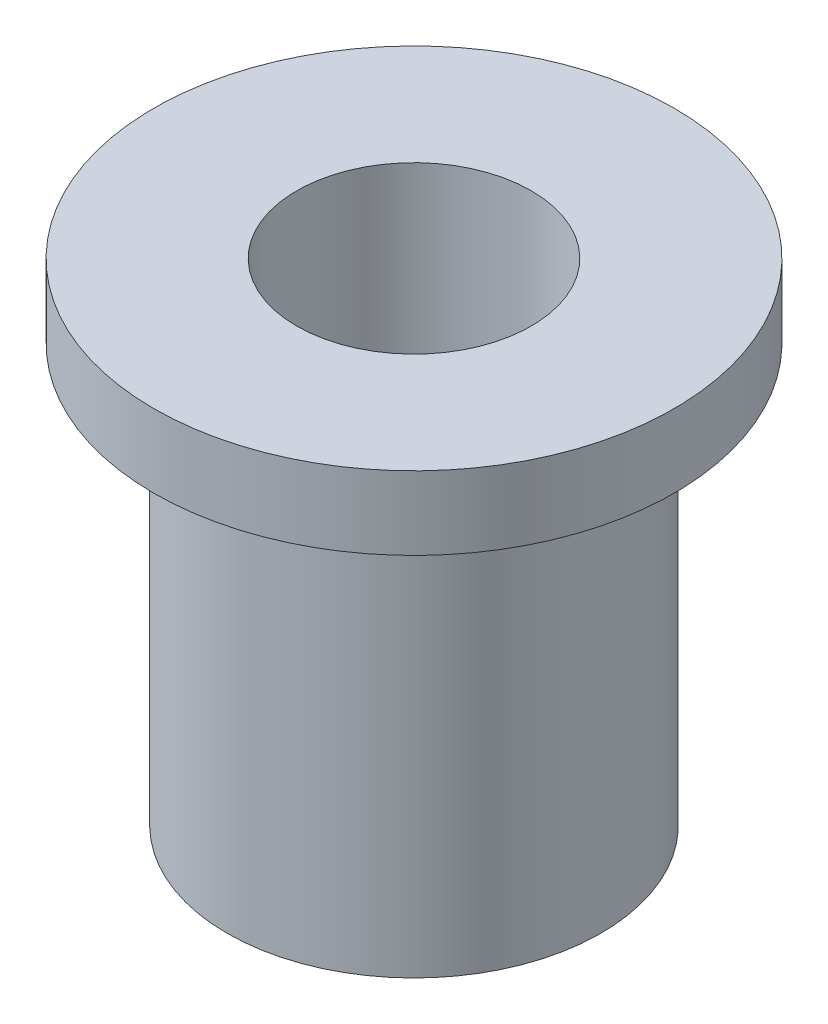
ISO-10303-21;
HEADER;
FILE_DESCRIPTION(('STEP AP214'),'2;1');
FILE_NAME('part.step','',(''),(''),'','','');
FILE_SCHEMA(('AUTOMOTIVE_DESIGN { 1 0 10303 214 1 1 1 1 }'));
ENDSEC;
DATA;
#1=APPLICATION_CONTEXT('core data for automotive mechanical design processes');
#2=APPLICATION_PROTOCOL_DEFINITION('international standard','automotive_design',2000,#1);
#3=PRODUCT_CONTEXT('',#1,'mechanical');
#4=PRODUCT('Part','Part','',(#3));
#5=PRODUCT_RELATED_PRODUCT_CATEGORY('part','',(#4));
#6=PRODUCT_DEFINITION_FORMATION('','',#4);
#7=PRODUCT_DEFINITION_CONTEXT('part definition',#1,'design');
#8=PRODUCT_DEFINITION('design','',#6,#7);
#9=PRODUCT_DEFINITION_SHAPE('','',#8);
#10=(LENGTH_UNIT() NAMED_UNIT(*) SI_UNIT(.MILLI.,.METRE.));
#11=(NAMED_UNIT(*) PLANE_ANGLE_UNIT() SI_UNIT($,.RADIAN.));
#12=(NAMED_UNIT(*) SI_UNIT($,.STERADIAN.) SOLID_ANGLE_UNIT());
#13=UNCERTAINTY_MEASURE_WITH_UNIT(LENGTH_MEASURE(1.E-05),#10,'distance_accuracy_value','');
#14=(GEOMETRIC_REPRESENTATION_CONTEXT(3) GLOBAL_UNCERTAINTY_ASSIGNED_CONTEXT((#13)) GLOBAL_UNIT_ASSIGNED_CONTEXT((#10,
#11,#12)) REPRESENTATION_CONTEXT('',''));
#15=CARTESIAN_POINT('',(0.,0.,0.));
#16=DIRECTION('',(0.,0.,1.));
#17=DIRECTION('',(1.,0.,0.));
#18=AXIS2_PLACEMENT_3D('',#15,#16,#17);
#19=CARTESIAN_POINT('',(0.,6.7,0.));
#20=DIRECTION('',(0.,-1.,0.));
#21=DIRECTION('',(0.,0.,-1.));
#22=AXIS2_PLACEMENT_3D('',#19,#20,#21);
#23=CYLINDRICAL_SURFACE('',#22,2.55);
#24=CARTESIAN_POINT('',(0.,0.,0.));
#25=DIRECTION('',(0.,1.,0.));
#26=DIRECTION('',(0.,0.,1.));
#27=AXIS2_PLACEMENT_3D('',#24,#25,#26);
#28=CIRCLE('',#27,2.55);
#29=CARTESIAN_POINT('',(0.,0.,2.55));
#30=VERTEX_POINT('',#29);
#31=EDGE_CURVE('E46',#30,#30,#28,.T.);
#32=ORIENTED_EDGE('',*,*,#31,.T.);
#33=EDGE_LOOP('',(#32));
#34=FACE_BOUND('',#33,.T.);
#35=CARTESIAN_POINT('',(0.,5.7,0.));
#36=DIRECTION('',(0.,1.,0.));
#37=DIRECTION('',(0.,0.,1.));
#38=AXIS2_PLACEMENT_3D('',#35,#36,#37);
#39=CIRCLE('',#38,2.55);
#40=CARTESIAN_POINT('',(0.,5.7,2.55));
#41=VERTEX_POINT('',#40);
#42=EDGE_CURVE('E10',#41,#41,#39,.T.);
#43=ORIENTED_EDGE('',*,*,#42,.F.);
#44=EDGE_LOOP('',(#43));
#45=FACE_BOUND('',#44,.T.);
#46=ADVANCED_FACE('F43',(#34,#45),#23,.T.);
#47=CARTESIAN_POINT('',(0.,6.7,0.));
#48=DIRECTION('',(0.,1.,0.));
#49=DIRECTION('',(0.,0.,1.));
#50=AXIS2_PLACEMENT_3D('',#47,#48,#49);
#51=PLANE('',#50);
#52=CARTESIAN_POINT('',(0.,6.7,0.));
#53=DIRECTION('',(0.,1.,0.));
#54=DIRECTION('',(0.,0.,1.));
#55=AXIS2_PLACEMENT_3D('',#52,#53,#54);
#56=CIRCLE('',#55,1.6);
#57=CARTESIAN_POINT('',(0.,6.7,1.6));
#58=VERTEX_POINT('',#57);
#59=EDGE_CURVE('E56',#58,#58,#56,.T.);
#60=ORIENTED_EDGE('',*,*,#59,.F.);
#61=EDGE_LOOP('',(#60));
#62=FACE_BOUND('',#61,.T.);
#63=CARTESIAN_POINT('',(0.,6.7,0.));
#64=DIRECTION('',(0.,1.,0.));
#65=DIRECTION('',(0.,0.,1.));
#66=AXIS2_PLACEMENT_3D('',#63,#64,#65);
#67=CIRCLE('',#66,3.55);
#68=CARTESIAN_POINT('',(0.,6.7,3.55));
#69=VERTEX_POINT('',#68);
#70=EDGE_CURVE('E59',#69,#69,#67,.T.);
#71=ORIENTED_EDGE('',*,*,#70,.T.);
#72=EDGE_LOOP('',(#71));
#73=FACE_BOUND('',#72,.T.);
#74=ADVANCED_FACE('F77',(#62,#73),#51,.T.);
#75=CARTESIAN_POINT('',(0.,0.,0.));
#76=DIRECTION('',(0.,1.,0.));
#77=DIRECTION('',(0.,0.,1.));
#78=AXIS2_PLACEMENT_3D('',#75,#76,#77);
#79=PLANE('',#78);
#80=ORIENTED_EDGE('',*,*,#31,.F.);
#81=EDGE_LOOP('',(#80));
#82=FACE_BOUND('',#81,.T.);
#83=CARTESIAN_POINT('',(0.,0.,0.));
#84=DIRECTION('',(0.,1.,0.));
#85=DIRECTION('',(0.,0.,1.));
#86=AXIS2_PLACEMENT_3D('',#83,#84,#85);
#87=CIRCLE('',#86,1.6);
#88=CARTESIAN_POINT('',(0.,0.,1.6));
#89=VERTEX_POINT('',#88);
#90=EDGE_CURVE('E63',#89,#89,#87,.T.);
#91=ORIENTED_EDGE('',*,*,#90,.T.);
#92=EDGE_LOOP('',(#91));
#93=FACE_BOUND('',#92,.T.);
#94=ADVANCED_FACE('F96',(#82,#93),#79,.F.);
#95=CARTESIAN_POINT('',(0.,6.7,0.));
#96=DIRECTION('',(0.,-1.,0.));
#97=DIRECTION('',(0.,0.,-1.));
#98=AXIS2_PLACEMENT_3D('',#95,#96,#97);
#99=CYLINDRICAL_SURFACE('',#98,1.6);
#100=ORIENTED_EDGE('',*,*,#59,.T.);
#101=EDGE_LOOP('',(#100));
#102=FACE_BOUND('',#101,.T.);
#103=ORIENTED_EDGE('',*,*,#90,.F.);
#104=EDGE_LOOP('',(#103));
#105=FACE_BOUND('',#104,.T.);
#106=ADVANCED_FACE('F86',(#102,#105),#99,.F.);
#107=CARTESIAN_POINT('',(0.,5.7,0.));
#108=DIRECTION('',(0.,1.,0.));
#109=DIRECTION('',(0.,0.,1.));
#110=AXIS2_PLACEMENT_3D('',#107,#108,#109);
#111=PLANE('',#110);
#112=CARTESIAN_POINT('',(0.,5.7,0.));
#113=DIRECTION('',(0.,1.,0.));
#114=DIRECTION('',(0.,0.,1.));
#115=AXIS2_PLACEMENT_3D('',#112,#113,#114);
#116=CIRCLE('',#115,3.55);
#117=CARTESIAN_POINT('',(0.,5.7,3.55));
#118=VERTEX_POINT('',#117);
#119=EDGE_CURVE('E66',#118,#118,#116,.T.);
#120=ORIENTED_EDGE('',*,*,#119,.F.);
#121=EDGE_LOOP('',(#120));
#122=FACE_BOUND('',#121,.T.);
#123=ORIENTED_EDGE('',*,*,#42,.T.);
#124=EDGE_LOOP('',(#123));
#125=FACE_BOUND('',#124,.T.);
#126=ADVANCED_FACE('F81',(#122,#125),#111,.F.);
#127=CARTESIAN_POINT('',(0.,5.7,0.));
#128=DIRECTION('',(0.,1.,0.));
#129=DIRECTION('',(0.,0.,1.));
#130=AXIS2_PLACEMENT_3D('',#127,#128,#129);
#131=CYLINDRICAL_SURFACE('',#130,3.55);
#132=ORIENTED_EDGE('',*,*,#119,.T.);
#133=EDGE_LOOP('',(#132));
#134=FACE_BOUND('',#133,.T.);
#135=ORIENTED_EDGE('',*,*,#70,.F.);
#136=EDGE_LOOP('',(#135));
#137=FACE_BOUND('',#136,.T.);
#138=ADVANCED_FACE('F79',(#134,#137),#131,.T.);
#139=CLOSED_SHELL('',(#46,#74,#94,#106,#126,#138));
#140=MANIFOLD_SOLID_BREP('B2',#139);
#141=ADVANCED_BREP_SHAPE_REPRESENTATION('',(#18,#140),#14);
#142=SHAPE_DEFINITION_REPRESENTATION(#9,#141);
ENDSEC;
END-ISO-10303-21;
